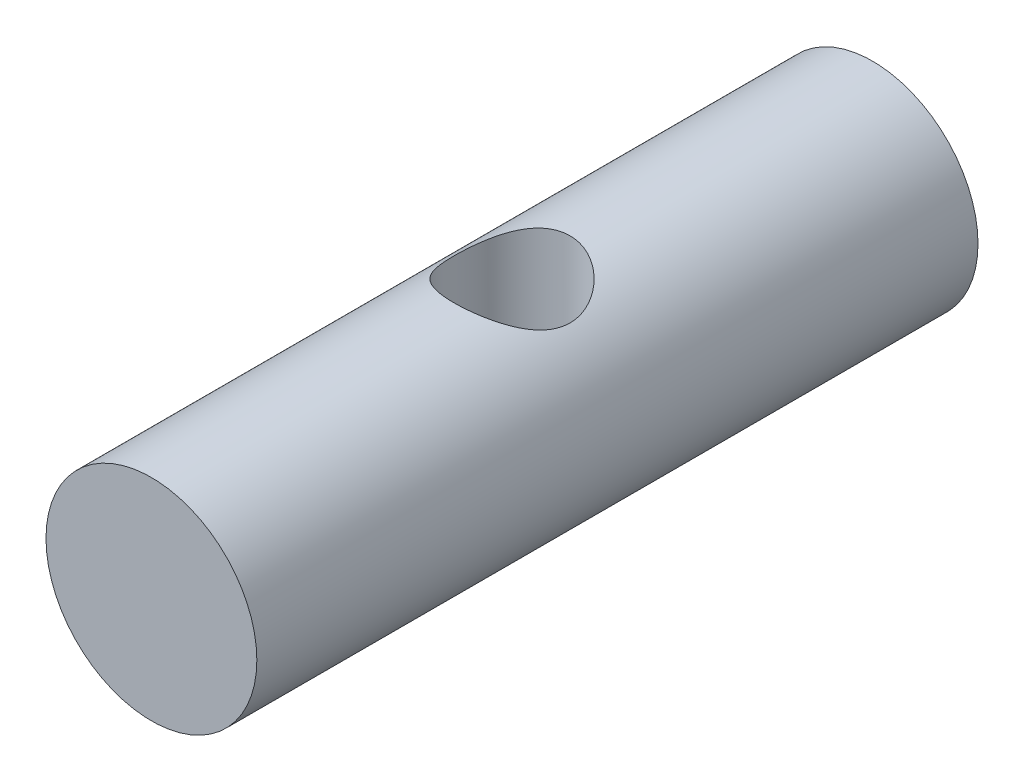
ISO-10303-21;
HEADER;
FILE_DESCRIPTION(('STEP AP214'),'2;1');
FILE_NAME('part.step','',(''),(''),'','','');
FILE_SCHEMA(('AUTOMOTIVE_DESIGN { 1 0 10303 214 1 1 1 1 }'));
ENDSEC;
DATA;
#1=APPLICATION_CONTEXT('core data for automotive mechanical design processes');
#2=APPLICATION_PROTOCOL_DEFINITION('international standard','automotive_design',2000,#1);
#3=PRODUCT_CONTEXT('',#1,'mechanical');
#4=PRODUCT('Part','Part','',(#3));
#5=PRODUCT_RELATED_PRODUCT_CATEGORY('part','',(#4));
#6=PRODUCT_DEFINITION_FORMATION('','',#4);
#7=PRODUCT_DEFINITION_CONTEXT('part definition',#1,'design');
#8=PRODUCT_DEFINITION('design','',#6,#7);
#9=PRODUCT_DEFINITION_SHAPE('','',#8);
#10=(LENGTH_UNIT() NAMED_UNIT(*) SI_UNIT(.MILLI.,.METRE.));
#11=(NAMED_UNIT(*) PLANE_ANGLE_UNIT() SI_UNIT($,.RADIAN.));
#12=(NAMED_UNIT(*) SI_UNIT($,.STERADIAN.) SOLID_ANGLE_UNIT());
#13=UNCERTAINTY_MEASURE_WITH_UNIT(LENGTH_MEASURE(1.E-05),#10,'distance_accuracy_value','');
#14=(GEOMETRIC_REPRESENTATION_CONTEXT(3) GLOBAL_UNCERTAINTY_ASSIGNED_CONTEXT((#13)) GLOBAL_UNIT_ASSIGNED_CONTEXT((#10,
#11,#12)) REPRESENTATION_CONTEXT('',''));
#15=CARTESIAN_POINT('',(0.,0.,0.));
#16=DIRECTION('',(0.,0.,1.));
#17=DIRECTION('',(1.,0.,0.));
#18=AXIS2_PLACEMENT_3D('',#15,#16,#17);
#19=CARTESIAN_POINT('',(0.,0.,5.9944));
#20=DIRECTION('',(0.,0.,-1.));
#21=DIRECTION('',(-1.,0.,0.));
#22=AXIS2_PLACEMENT_3D('',#19,#20,#21);
#23=CYLINDRICAL_SURFACE('',#22,1.7526);
#24=CARTESIAN_POINT('',(0.,-1.7526,0.9652));
#25=CARTESIAN_POINT('',(0.05010494188375,-1.75259716212897,0.965196858881249));
#26=CARTESIAN_POINT('',(0.100250042402794,-1.75042950666842,0.961275954483073));
#27=CARTESIAN_POINT('',(0.199018293636773,-1.74197160530093,0.945785303394575));
#28=CARTESIAN_POINT('',(0.247639285264194,-1.73567576540056,0.934205177710586));
#29=CARTESIAN_POINT('',(0.341788752427753,-1.7196102803171,0.904005578636843));
#30=CARTESIAN_POINT('',(0.387329078777486,-1.70985496893398,0.885415131618682));
#31=CARTESIAN_POINT('',(0.474552533265949,-1.68773051596807,0.841896145209955));
#32=CARTESIAN_POINT('',(0.516235490361952,-1.67536125855797,0.816967324947959));
#33=CARTESIAN_POINT('',(0.597790461789448,-1.6480979938165,0.759548275854969));
#34=CARTESIAN_POINT('',(0.637339777319161,-1.6330887455654,0.726655382598738));
#35=CARTESIAN_POINT('',(0.71066604275277,-1.60254215965567,0.655127695437789));
#36=CARTESIAN_POINT('',(0.744437581505689,-1.58700434311579,0.616487581614247));
#37=CARTESIAN_POINT('',(0.808622500025961,-1.55535824331261,0.530017600475483));
#38=CARTESIAN_POINT('',(0.838373984033936,-1.53934538175422,0.481656898900256));
#39=CARTESIAN_POINT('',(0.889207160332095,-1.51055468569188,0.379683660741558));
#40=CARTESIAN_POINT('',(0.910295707681664,-1.49777429639345,0.32607531842434));
#41=CARTESIAN_POINT('',(0.941704980884258,-1.47821650316089,0.218490070009699));
#42=CARTESIAN_POINT('',(0.952621824786088,-1.47111085355914,0.164750426959502));
#43=CARTESIAN_POINT('',(0.96514054161085,-1.46293320289167,0.0557755221883965));
#44=CARTESIAN_POINT('',(0.966755844802206,-1.46185250262003,0.000542532588916263));
#45=CARTESIAN_POINT('',(0.961060201144099,-1.46559612537389,-0.100727823081091));
#46=CARTESIAN_POINT('',(0.955074796339784,-1.4695438391758,-0.146881324211864));
#47=CARTESIAN_POINT('',(0.936693457297422,-1.48132720477939,-0.237380351084657));
#48=CARTESIAN_POINT('',(0.924294587027795,-1.48916463719551,-0.281725038727288));
#49=CARTESIAN_POINT('',(0.893276707548279,-1.50797760989102,-0.368567063455183));
#50=CARTESIAN_POINT('',(0.874529641163139,-1.51901702400484,-0.411004147485716));
#51=CARTESIAN_POINT('',(0.831458617190921,-1.54301352815683,-0.492349727929058));
#52=CARTESIAN_POINT('',(0.807132256012747,-1.55597144384083,-0.53125669343612));
#53=CARTESIAN_POINT('',(0.749123666843673,-1.58481134204598,-0.610918321482393));
#54=CARTESIAN_POINT('',(0.714570045648412,-1.60083152817589,-0.65099081846822));
#55=CARTESIAN_POINT('',(0.639255344787504,-1.63236872191594,-0.725090928475726));
#56=CARTESIAN_POINT('',(0.598490033237419,-1.64788537767365,-0.759114385920744));
#57=CARTESIAN_POINT('',(0.508486724638308,-1.67792860020322,-0.822359324460979));
#58=CARTESIAN_POINT('',(0.458862825298139,-1.69231791515211,-0.851102496345792));
#59=CARTESIAN_POINT('',(0.354500892868835,-1.71720793461286,-0.899578410274056));
#60=CARTESIAN_POINT('',(0.299767737201193,-1.72771230119673,-0.91931964193478));
#61=CARTESIAN_POINT('',(0.192197180454479,-1.74279565680101,-0.947346942095294));
#62=CARTESIAN_POINT('',(0.139659138243063,-1.74783594246604,-0.956529732696672));
#63=CARTESIAN_POINT('',(0.0335600335817548,-1.75308138975663,-0.966082886827408));
#64=CARTESIAN_POINT('',(-0.0200003501853343,-1.75328965455926,-0.966458906163848));
#65=CARTESIAN_POINT('',(-0.1210054888095,-1.74907670592519,-0.958791170486842));
#66=CARTESIAN_POINT('',(-0.168534987075387,-1.7451073845226,-0.951569311917954));
#67=CARTESIAN_POINT('',(-0.261583797328272,-1.73360284651676,-0.930302626187803));
#68=CARTESIAN_POINT('',(-0.307102905734928,-1.7260672696809,-0.916257109755186));
#69=CARTESIAN_POINT('',(-0.396060735851477,-1.70787929872278,-0.881521030402619));
#70=CARTESIAN_POINT('',(-0.439430233965441,-1.69716101526493,-0.860688982633696));
#71=CARTESIAN_POINT('',(-0.522170672422531,-1.6735586021153,-0.813159235887626));
#72=CARTESIAN_POINT('',(-0.561540148342359,-1.66067368376105,-0.786459399925379));
#73=CARTESIAN_POINT('',(-0.639866481494634,-1.63220781209276,-0.724531802747728));
#74=CARTESIAN_POINT('',(-0.678282148460724,-1.61648655466217,-0.688683526440322));
#75=CARTESIAN_POINT('',(-0.748847710441291,-1.5850329935205,-0.611218213077967));
#76=CARTESIAN_POINT('',(-0.780991042195696,-1.56930069534351,-0.569595210523359));
#77=CARTESIAN_POINT('',(-0.840565700058779,-1.53826863320415,-0.477789450765024));
#78=CARTESIAN_POINT('',(-0.867432432589454,-1.52309876669867,-0.427191950101781));
#79=CARTESIAN_POINT('',(-0.912014364042174,-1.49683436435242,-0.321148405785081));
#80=CARTESIAN_POINT('',(-0.92974289913623,-1.48573389655811,-0.265709566591606));
#81=CARTESIAN_POINT('',(-0.953771512562124,-1.47041255560167,-0.15719704150607));
#82=CARTESIAN_POINT('',(-0.961012363840101,-1.46562938555445,-0.104414532170551));
#83=CARTESIAN_POINT('',(-0.966658818949073,-1.46191409733853,0.00180857913157739));
#84=CARTESIAN_POINT('',(-0.965072083471271,-1.46297690594672,0.0552485703481953));
#85=CARTESIAN_POINT('',(-0.954025229793151,-1.47019472939576,0.153461914016845));
#86=CARTESIAN_POINT('',(-0.945671500523948,-1.47563348982995,0.198421049224781));
#87=CARTESIAN_POINT('',(-0.922907912378091,-1.48997572528842,0.286197500125105));
#88=CARTESIAN_POINT('',(-0.908495553400848,-1.49888063050889,0.329013923453505));
#89=CARTESIAN_POINT('',(-0.873084038892062,-1.51979497124466,0.414239739362985));
#90=CARTESIAN_POINT('',(-0.85173632638711,-1.53196081126489,0.456464527077283));
#91=CARTESIAN_POINT('',(-0.803389452789985,-1.55785887523145,0.537015627523268));
#92=CARTESIAN_POINT('',(-0.776387296133459,-1.5715919276807,0.575339857793559));
#93=CARTESIAN_POINT('',(-0.712548937138895,-1.60165906462412,0.653304483779006));
#94=CARTESIAN_POINT('',(-0.674833821143107,-1.61806230967895,0.692202515376771));
#95=CARTESIAN_POINT('',(-0.593134454699137,-1.64976319062136,0.763373182227377));
#96=CARTESIAN_POINT('',(-0.549145720884235,-1.66506002393982,0.795641038703658));
#97=CARTESIAN_POINT('',(-0.454064761204723,-1.69351089766229,0.853606225030565));
#98=CARTESIAN_POINT('',(-0.402776672071709,-1.7065702975558,0.879031574980305));
#99=CARTESIAN_POINT('',(-0.295758138698332,-1.72832071513987,0.920549866235502));
#100=CARTESIAN_POINT('',(-0.240039485214858,-1.73702290544181,0.936666692625076));
#101=CARTESIAN_POINT('',(-0.153058397813086,-1.74616763954718,0.953481052993227));
#102=CARTESIAN_POINT('',(-0.122668812703854,-1.74857003234623,0.957865943319128));
#103=CARTESIAN_POINT('',(-0.061524529487554,-1.75178707126074,0.963726358059933));
#104=CARTESIAN_POINT('',(-0.0307698372252995,-1.75260174275883,0.965201928985626));
#105=CARTESIAN_POINT('',(0.,-1.7526,0.9652));
#106=B_SPLINE_CURVE_WITH_KNOTS('',3,(#24,#25,#26,#27,#28,#29,#30,#31,#32,#33,#34,#35,#36,#37,
#38,#39,#40,#41,#42,#43,#44,#45,#46,#47,#48,#49,#50,#51,#52,#53,#54,#55,#56,#57,#58,#59,#60,#61,
#62,#63,#64,#65,#66,#67,#68,#69,#70,#71,#72,#73,#74,#75,#76,#77,#78,#79,#80,#81,#82,#83,#84,#85,
#86,#87,#88,#89,#90,#91,#92,#93,#94,#95,#96,#97,#98,#99,#100,#101,#102,#103,#104,#105),
.UNSPECIFIED.,.T.,.F.,(4,2,2,2,2,2,2,2,2,2,2,2,2,2,2,2,2,2,2,2,2,2,2,2,2,2,2,2,2,2,2,2,2,2,2,2,
2,2,2,2,4),(0.,0.150190964449038,0.300585870464582,0.450364781688751,0.600150331201518,
0.760257038758922,0.920512882311902,1.09660920386564,1.27256590914317,1.43740596287336,
1.60200794826347,1.7414719282281,1.88099981023151,2.02352890501136,2.16611951783554,
2.33127801093409,2.49654953005706,2.67296203249194,2.84920781665311,3.00901439032334,
3.16871833160711,3.31276420950994,3.45682464080178,3.60410444234163,3.7514379707437,
3.91529082029522,4.0793142138389,4.25615666615318,4.43274030083353,4.59221696857764,
4.75155526205662,4.88910344935222,5.0267084518699,5.1727184986555,5.31880609400978,
5.48788862374002,5.65709259747299,5.83226625220809,6.00698840228711,6.09922332438448,
6.19145677192603),.UNSPECIFIED.);
#107=CARTESIAN_POINT('',(0.,-1.7526,0.9652));
#108=VERTEX_POINT('',#107);
#109=EDGE_CURVE('E34',#108,#108,#106,.T.);
#110=ORIENTED_EDGE('',*,*,#109,.T.);
#111=EDGE_LOOP('',(#110));
#112=FACE_BOUND('',#111,.T.);
#113=CARTESIAN_POINT('',(0.,1.7526,0.9652));
#114=CARTESIAN_POINT('',(-0.05010494188375,1.75259716212897,0.965196858881249));
#115=CARTESIAN_POINT('',(-0.100250042402794,1.75042950666842,0.961275954483073));
#116=CARTESIAN_POINT('',(-0.199018293636773,1.74197160530093,0.945785303394575));
#117=CARTESIAN_POINT('',(-0.247639285264193,1.73567576540056,0.934205177710586));
#118=CARTESIAN_POINT('',(-0.341788752427753,1.7196102803171,0.904005578636843));
#119=CARTESIAN_POINT('',(-0.387329078777486,1.70985496893398,0.885415131618682));
#120=CARTESIAN_POINT('',(-0.474552533265949,1.68773051596807,0.841896145209955));
#121=CARTESIAN_POINT('',(-0.516235490361952,1.67536125855797,0.816967324947959));
#122=CARTESIAN_POINT('',(-0.597790461789448,1.6480979938165,0.759548275854969));
#123=CARTESIAN_POINT('',(-0.637339777319161,1.6330887455654,0.726655382598738));
#124=CARTESIAN_POINT('',(-0.71066604275277,1.60254215965567,0.655127695437789));
#125=CARTESIAN_POINT('',(-0.744437581505689,1.58700434311579,0.616487581614247));
#126=CARTESIAN_POINT('',(-0.808622500025961,1.55535824331261,0.530017600475483));
#127=CARTESIAN_POINT('',(-0.838373984033936,1.53934538175422,0.481656898900256));
#128=CARTESIAN_POINT('',(-0.889207160332095,1.51055468569188,0.379683660741558));
#129=CARTESIAN_POINT('',(-0.910295707681664,1.49777429639345,0.32607531842434));
#130=CARTESIAN_POINT('',(-0.941704980884258,1.47821650316089,0.218490070009699));
#131=CARTESIAN_POINT('',(-0.952621824786087,1.47111085355914,0.164750426959503));
#132=CARTESIAN_POINT('',(-0.96514054161085,1.46293320289167,0.0557755221883967));
#133=CARTESIAN_POINT('',(-0.966755844802206,1.46185250262003,0.000542532588916473));
#134=CARTESIAN_POINT('',(-0.961060201144099,1.46559612537389,-0.10072782308109));
#135=CARTESIAN_POINT('',(-0.955074796339784,1.4695438391758,-0.146881324211864));
#136=CARTESIAN_POINT('',(-0.936693457297422,1.48132720477939,-0.237380351084657));
#137=CARTESIAN_POINT('',(-0.924294587027795,1.48916463719551,-0.281725038727288));
#138=CARTESIAN_POINT('',(-0.893276707548279,1.50797760989102,-0.368567063455182));
#139=CARTESIAN_POINT('',(-0.874529641163139,1.51901702400484,-0.411004147485716));
#140=CARTESIAN_POINT('',(-0.831458617190921,1.54301352815683,-0.492349727929057));
#141=CARTESIAN_POINT('',(-0.807132256012747,1.55597144384083,-0.531256693436119));
#142=CARTESIAN_POINT('',(-0.749123666843673,1.58481134204598,-0.610918321482392));
#143=CARTESIAN_POINT('',(-0.714570045648413,1.60083152817589,-0.65099081846822));
#144=CARTESIAN_POINT('',(-0.639255344787505,1.63236872191594,-0.725090928475726));
#145=CARTESIAN_POINT('',(-0.59849003323742,1.64788537767365,-0.759114385920744));
#146=CARTESIAN_POINT('',(-0.508486724638308,1.67792860020322,-0.822359324460979));
#147=CARTESIAN_POINT('',(-0.458862825298139,1.69231791515211,-0.851102496345791));
#148=CARTESIAN_POINT('',(-0.354500892868835,1.71720793461286,-0.899578410274056));
#149=CARTESIAN_POINT('',(-0.299767737201194,1.72771230119673,-0.91931964193478));
#150=CARTESIAN_POINT('',(-0.192197180454479,1.74279565680101,-0.947346942095294));
#151=CARTESIAN_POINT('',(-0.139659138243063,1.74783594246604,-0.956529732696672));
#152=CARTESIAN_POINT('',(-0.033560033581755,1.75308138975663,-0.966082886827408));
#153=CARTESIAN_POINT('',(0.0200003501853341,1.75328965455926,-0.966458906163848));
#154=CARTESIAN_POINT('',(0.1210054888095,1.74907670592519,-0.958791170486842));
#155=CARTESIAN_POINT('',(0.168534987075386,1.7451073845226,-0.951569311917954));
#156=CARTESIAN_POINT('',(0.261583797328271,1.73360284651676,-0.930302626187803));
#157=CARTESIAN_POINT('',(0.307102905734928,1.7260672696809,-0.916257109755186));
#158=CARTESIAN_POINT('',(0.396060735851477,1.70787929872278,-0.881521030402619));
#159=CARTESIAN_POINT('',(0.439430233965441,1.69716101526493,-0.860688982633696));
#160=CARTESIAN_POINT('',(0.522170672422531,1.6735586021153,-0.813159235887626));
#161=CARTESIAN_POINT('',(0.561540148342359,1.66067368376105,-0.786459399925379));
#162=CARTESIAN_POINT('',(0.639866481494634,1.63220781209276,-0.724531802747728));
#163=CARTESIAN_POINT('',(0.678282148460723,1.61648655466217,-0.688683526440322));
#164=CARTESIAN_POINT('',(0.748847710441291,1.5850329935205,-0.611218213077967));
#165=CARTESIAN_POINT('',(0.780991042195696,1.56930069534351,-0.569595210523359));
#166=CARTESIAN_POINT('',(0.840565700058779,1.53826863320415,-0.477789450765024));
#167=CARTESIAN_POINT('',(0.867432432589454,1.52309876669867,-0.427191950101781));
#168=CARTESIAN_POINT('',(0.912014364042174,1.49683436435242,-0.321148405785081));
#169=CARTESIAN_POINT('',(0.92974289913623,1.48573389655811,-0.265709566591606));
#170=CARTESIAN_POINT('',(0.953771512562124,1.47041255560167,-0.15719704150607));
#171=CARTESIAN_POINT('',(0.961012363840101,1.46562938555445,-0.104414532170552));
#172=CARTESIAN_POINT('',(0.966658818949073,1.46191409733853,0.00180857913157696));
#173=CARTESIAN_POINT('',(0.965072083471271,1.46297690594672,0.0552485703481949));
#174=CARTESIAN_POINT('',(0.954025229793151,1.47019472939576,0.153461914016844));
#175=CARTESIAN_POINT('',(0.945671500523948,1.47563348982995,0.198421049224781));
#176=CARTESIAN_POINT('',(0.922907912378091,1.48997572528842,0.286197500125104));
#177=CARTESIAN_POINT('',(0.908495553400849,1.49888063050889,0.329013923453504));
#178=CARTESIAN_POINT('',(0.873084038892062,1.51979497124466,0.414239739362985));
#179=CARTESIAN_POINT('',(0.85173632638711,1.53196081126489,0.456464527077283));
#180=CARTESIAN_POINT('',(0.803389452789985,1.55785887523145,0.537015627523268));
#181=CARTESIAN_POINT('',(0.77638729613346,1.5715919276807,0.575339857793559));
#182=CARTESIAN_POINT('',(0.712548937138895,1.60165906462412,0.653304483779006));
#183=CARTESIAN_POINT('',(0.674833821143108,1.61806230967895,0.692202515376771));
#184=CARTESIAN_POINT('',(0.593134454699137,1.64976319062136,0.763373182227377));
#185=CARTESIAN_POINT('',(0.549145720884235,1.66506002393982,0.795641038703657));
#186=CARTESIAN_POINT('',(0.454064761204724,1.69351089766229,0.853606225030565));
#187=CARTESIAN_POINT('',(0.40277667207171,1.7065702975558,0.879031574980304));
#188=CARTESIAN_POINT('',(0.295758138698333,1.72832071513987,0.920549866235502));
#189=CARTESIAN_POINT('',(0.240039485214858,1.73702290544181,0.936666692625076));
#190=CARTESIAN_POINT('',(0.153058397813087,1.74616763954718,0.953481052993227));
#191=CARTESIAN_POINT('',(0.122668812703855,1.74857003234623,0.957865943319128));
#192=CARTESIAN_POINT('',(0.0615245294875545,1.75178707126074,0.963726358059933));
#193=CARTESIAN_POINT('',(0.0307698372252998,1.75260174275883,0.965201928985626));
#194=CARTESIAN_POINT('',(0.,1.7526,0.9652));
#195=B_SPLINE_CURVE_WITH_KNOTS('',3,(#113,#114,#115,#116,#117,#118,#119,#120,#121,#122,#123,
#124,#125,#126,#127,#128,#129,#130,#131,#132,#133,#134,#135,#136,#137,#138,#139,#140,#141,#142,
#143,#144,#145,#146,#147,#148,#149,#150,#151,#152,#153,#154,#155,#156,#157,#158,#159,#160,#161,
#162,#163,#164,#165,#166,#167,#168,#169,#170,#171,#172,#173,#174,#175,#176,#177,#178,#179,#180,
#181,#182,#183,#184,#185,#186,#187,#188,#189,#190,#191,#192,#193,#194),.UNSPECIFIED.,.T.,.F.,(4,
2,2,2,2,2,2,2,2,2,2,2,2,2,2,2,2,2,2,2,2,2,2,2,2,2,2,2,2,2,2,2,2,2,2,2,2,2,2,2,4),(0.,
0.150190964449038,0.300585870464582,0.450364781688751,0.600150331201518,0.760257038758922,
0.920512882311902,1.09660920386564,1.27256590914317,1.43740596287336,1.60200794826347,
1.7414719282281,1.88099981023151,2.02352890501136,2.16611951783554,2.33127801093409,
2.49654953005706,2.67296203249194,2.84920781665311,3.00901439032334,3.16871833160711,
3.31276420950994,3.45682464080178,3.60410444234163,3.7514379707437,3.91529082029522,
4.0793142138389,4.25615666615317,4.43274030083353,4.59221696857763,4.75155526205662,
4.88910344935221,5.0267084518699,5.1727184986555,5.31880609400978,5.48788862374001,
5.65709259747298,5.83226625220809,6.0069884022871,6.09922332438447,6.19145677192603),.UNSPECIFIED.);
#196=CARTESIAN_POINT('',(0.,1.7526,0.9652));
#197=VERTEX_POINT('',#196);
#198=EDGE_CURVE('E48',#197,#197,#195,.T.);
#199=ORIENTED_EDGE('',*,*,#198,.T.);
#200=EDGE_LOOP('',(#199));
#201=FACE_BOUND('',#200,.T.);
#202=CARTESIAN_POINT('',(0.,0.,5.9944));
#203=DIRECTION('',(0.,0.,1.));
#204=DIRECTION('',(1.,0.,0.));
#205=AXIS2_PLACEMENT_3D('',#202,#203,#204);
#206=CIRCLE('',#205,1.7526);
#207=CARTESIAN_POINT('',(1.7526,0.,5.9944));
#208=VERTEX_POINT('',#207);
#209=EDGE_CURVE('E10',#208,#208,#206,.T.);
#210=ORIENTED_EDGE('',*,*,#209,.F.);
#211=EDGE_LOOP('',(#210));
#212=FACE_BOUND('',#211,.T.);
#213=CARTESIAN_POINT('',(0.,0.,-5.9944));
#214=DIRECTION('',(0.,0.,1.));
#215=DIRECTION('',(1.,0.,0.));
#216=AXIS2_PLACEMENT_3D('',#213,#214,#215);
#217=CIRCLE('',#216,1.7526);
#218=CARTESIAN_POINT('',(1.7526,0.,-5.9944));
#219=VERTEX_POINT('',#218);
#220=EDGE_CURVE('E42',#219,#219,#217,.T.);
#221=ORIENTED_EDGE('',*,*,#220,.T.);
#222=EDGE_LOOP('',(#221));
#223=FACE_BOUND('',#222,.T.);
#224=ADVANCED_FACE('F30',(#112,#201,#212,#223),#23,.T.);
#225=CARTESIAN_POINT('',(0.,0.,5.9944));
#226=DIRECTION('',(0.,0.,1.));
#227=DIRECTION('',(1.,0.,0.));
#228=AXIS2_PLACEMENT_3D('',#225,#226,#227);
#229=PLANE('',#228);
#230=ORIENTED_EDGE('',*,*,#209,.T.);
#231=EDGE_LOOP('',(#230));
#232=FACE_BOUND('',#231,.T.);
#233=ADVANCED_FACE('F59',(#232),#229,.T.);
#234=CARTESIAN_POINT('',(0.,0.,-5.9944));
#235=DIRECTION('',(0.,0.,1.));
#236=DIRECTION('',(1.,0.,0.));
#237=AXIS2_PLACEMENT_3D('',#234,#235,#236);
#238=PLANE('',#237);
#239=ORIENTED_EDGE('',*,*,#220,.F.);
#240=EDGE_LOOP('',(#239));
#241=FACE_BOUND('',#240,.T.);
#242=ADVANCED_FACE('F57',(#241),#238,.F.);
#243=CARTESIAN_POINT('',(0.,-3.4544,0.));
#244=DIRECTION('',(0.,1.,0.));
#245=DIRECTION('',(0.,0.,1.));
#246=AXIS2_PLACEMENT_3D('',#243,#244,#245);
#247=CYLINDRICAL_SURFACE('',#246,0.9652);
#248=ORIENTED_EDGE('',*,*,#198,.F.);
#249=EDGE_LOOP('',(#248));
#250=FACE_BOUND('',#249,.T.);
#251=ORIENTED_EDGE('',*,*,#109,.F.);
#252=EDGE_LOOP('',(#251));
#253=FACE_BOUND('',#252,.T.);
#254=ADVANCED_FACE('F53',(#250,#253),#247,.F.);
#255=CLOSED_SHELL('',(#224,#233,#242,#254));
#256=MANIFOLD_SOLID_BREP('B2',#255);
#257=ADVANCED_BREP_SHAPE_REPRESENTATION('',(#18,#256),#14);
#258=SHAPE_DEFINITION_REPRESENTATION(#9,#257);
ENDSEC;
END-ISO-10303-21;
